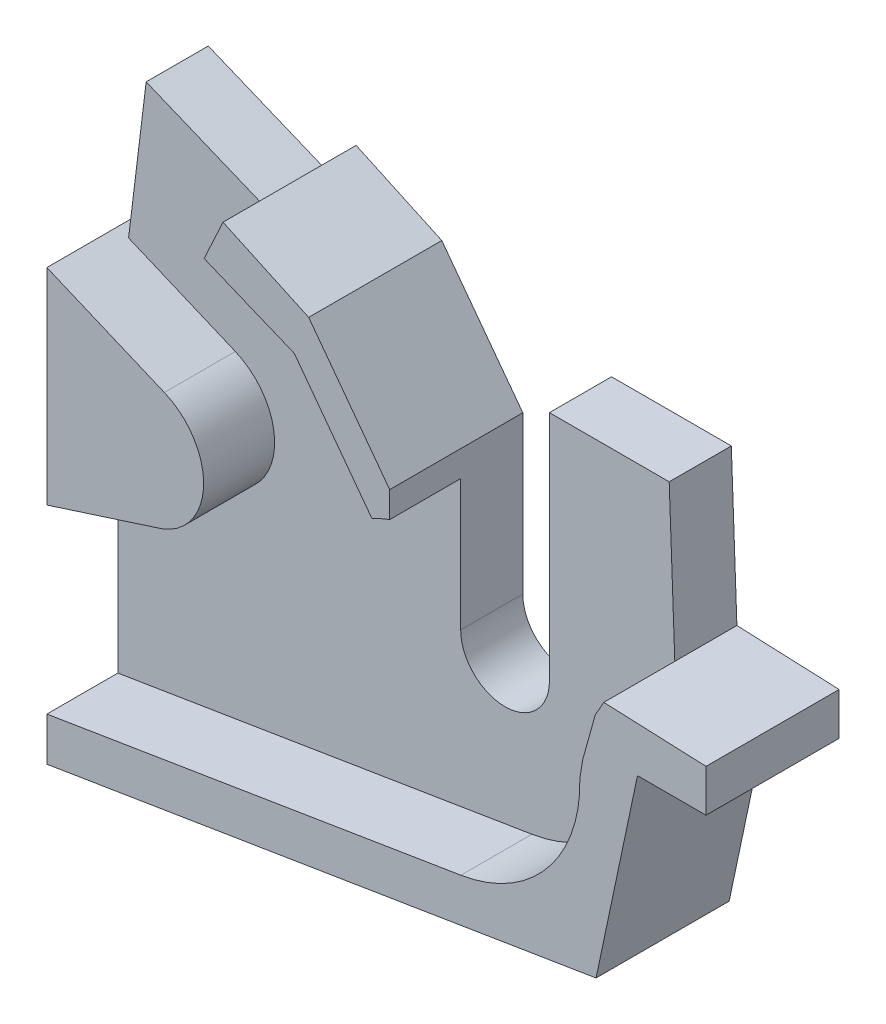
ISO-10303-21;
HEADER;
FILE_DESCRIPTION(('STEP AP214'),'2;1');
FILE_NAME('part.step','',(''),(''),'','','');
FILE_SCHEMA(('AUTOMOTIVE_DESIGN { 1 0 10303 214 1 1 1 1 }'));
ENDSEC;
DATA;
#1=APPLICATION_CONTEXT('core data for automotive mechanical design processes');
#2=APPLICATION_PROTOCOL_DEFINITION('international standard','automotive_design',2000,#1);
#3=PRODUCT_CONTEXT('',#1,'mechanical');
#4=PRODUCT('Part','Part','',(#3));
#5=PRODUCT_RELATED_PRODUCT_CATEGORY('part','',(#4));
#6=PRODUCT_DEFINITION_FORMATION('','',#4);
#7=PRODUCT_DEFINITION_CONTEXT('part definition',#1,'design');
#8=PRODUCT_DEFINITION('design','',#6,#7);
#9=PRODUCT_DEFINITION_SHAPE('','',#8);
#10=(LENGTH_UNIT() NAMED_UNIT(*) SI_UNIT(.MILLI.,.METRE.));
#11=(NAMED_UNIT(*) PLANE_ANGLE_UNIT() SI_UNIT($,.RADIAN.));
#12=(NAMED_UNIT(*) SI_UNIT($,.STERADIAN.) SOLID_ANGLE_UNIT());
#13=UNCERTAINTY_MEASURE_WITH_UNIT(LENGTH_MEASURE(1.E-05),#10,'distance_accuracy_value','');
#14=(GEOMETRIC_REPRESENTATION_CONTEXT(3) GLOBAL_UNCERTAINTY_ASSIGNED_CONTEXT((#13)) GLOBAL_UNIT_ASSIGNED_CONTEXT((#10,
#11,#12)) REPRESENTATION_CONTEXT('',''));
#15=CARTESIAN_POINT('',(0.,0.,0.));
#16=DIRECTION('',(0.,0.,1.));
#17=DIRECTION('',(1.,0.,0.));
#18=AXIS2_PLACEMENT_3D('',#15,#16,#17);
#19=CARTESIAN_POINT('',(0.,0.,7.));
#20=DIRECTION('',(0.,0.,1.));
#21=DIRECTION('',(1.,0.,0.));
#22=AXIS2_PLACEMENT_3D('',#19,#20,#21);
#23=PLANE('',#22);
#24=DIRECTION('',(-0.986991690227506,-0.160771276731423,0.));
#25=VECTOR('',#24,1.);
#26=CARTESIAN_POINT('',(2.26037687324573,-13.8766901403845,7.));
#27=LINE('',#26,#25);
#28=CARTESIAN_POINT('',(7.11861567812569,-13.0853306354766,7.));
#29=VERTEX_POINT('',#28);
#30=CARTESIAN_POINT('',(-39.5424333152486,-20.6859583758814,7.));
#31=VERTEX_POINT('',#30);
#32=EDGE_CURVE('E415',#29,#31,#27,.T.);
#33=ORIENTED_EDGE('',*,*,#32,.F.);
#34=CARTESIAN_POINT('',(4.59071046144304,2.65120936965711,7.));
#35=DIRECTION('',(0.,0.,1.));
#36=DIRECTION('',(1.,0.,0.));
#37=AXIS2_PLACEMENT_3D('',#34,#35,#36);
#38=CIRCLE('',#37,15.9382871136676);
#39=CARTESIAN_POINT('',(20.5233035123729,3.07720795083632,7.));
#40=VERTEX_POINT('',#39);
#41=EDGE_CURVE('E336',#40,#29,#38,.F.);
#42=ORIENTED_EDGE('',*,*,#41,.F.);
#43=DIRECTION('',(0.161052296150216,0.98694587384757,0.));
#44=VECTOR('',#43,1.);
#45=CARTESIAN_POINT('',(19.5018514131188,-3.18236088978088,7.));
#46=LINE('',#45,#44);
#47=CARTESIAN_POINT('',(20.8501257943456,5.0800102106292,7.));
#48=VERTEX_POINT('',#47);
#49=EDGE_CURVE('E341',#40,#48,#46,.T.);
#50=ORIENTED_EDGE('',*,*,#49,.T.);
#51=DIRECTION('',(0.268749678176345,0.963210055221659,0.));
#52=VECTOR('',#51,1.);
#53=CARTESIAN_POINT('',(18.0291728908629,-5.03040264783163,7.));
#54=LINE('',#53,#52);
#55=CARTESIAN_POINT('',(22.2571862666276,10.1229736270083,7.));
#56=VERTEX_POINT('',#55);
#57=EDGE_CURVE('E407',#48,#56,#54,.T.);
#58=ORIENTED_EDGE('',*,*,#57,.T.);
#59=DIRECTION('',(0.491293878545191,0.87099387190957,0.));
#60=VECTOR('',#59,1.);
#61=CARTESIAN_POINT('',(12.553214742302,-7.08078180324617,7.));
#62=LINE('',#61,#60);
#63=CARTESIAN_POINT('',(23.2245967998316,11.83805432074,7.));
#64=VERTEX_POINT('',#63);
#65=EDGE_CURVE('E411',#56,#64,#62,.T.);
#66=ORIENTED_EDGE('',*,*,#65,.T.);
#67=DIRECTION('',(0.0365725060444202,-0.999331002121735,0.));
#68=VECTOR('',#67,1.);
#69=CARTESIAN_POINT('',(23.6261904545896,0.864647440510251,7.));
#70=LINE('',#69,#68);
#71=CARTESIAN_POINT('',(22.5946169567633,29.0520343287084,7.));
#72=VERTEX_POINT('',#71);
#73=EDGE_CURVE('E504',#72,#64,#70,.T.);
#74=ORIENTED_EDGE('',*,*,#73,.F.);
#75=DIRECTION('',(1.,0.,0.));
#76=VECTOR('',#75,1.);
#77=CARTESIAN_POINT('',(0.,29.0520343287084,7.));
#78=LINE('',#77,#76);
#79=CARTESIAN_POINT('',(9.09461695676328,29.0520343287084,7.));
#80=VERTEX_POINT('',#79);
#81=EDGE_CURVE('E508',#80,#72,#78,.T.);
#82=ORIENTED_EDGE('',*,*,#81,.F.);
#83=DIRECTION('',(0.,1.,0.));
#84=VECTOR('',#83,1.);
#85=CARTESIAN_POINT('',(9.09461695676327,0.,7.));
#86=LINE('',#85,#84);
#87=CARTESIAN_POINT('',(9.09461695676328,2.84690158384109,7.));
#88=VERTEX_POINT('',#87);
#89=EDGE_CURVE('E513',#88,#80,#86,.T.);
#90=ORIENTED_EDGE('',*,*,#89,.F.);
#91=CARTESIAN_POINT('',(4.09461695676328,2.84690158384109,7.));
#92=DIRECTION('',(0.,0.,1.));
#93=DIRECTION('',(1.,0.,0.));
#94=AXIS2_PLACEMENT_3D('',#91,#92,#93);
#95=CIRCLE('',#94,5.);
#96=CARTESIAN_POINT('',(-0.905383043236726,2.84690158384109,7.));
#97=VERTEX_POINT('',#96);
#98=EDGE_CURVE('E517',#97,#88,#95,.T.);
#99=ORIENTED_EDGE('',*,*,#98,.F.);
#100=DIRECTION('',(0.,1.,0.));
#101=VECTOR('',#100,1.);
#102=CARTESIAN_POINT('',(-0.905383043236726,0.,7.));
#103=LINE('',#102,#101);
#104=CARTESIAN_POINT('',(-0.905383043236726,17.6118895783081,7.));
#105=VERTEX_POINT('',#104);
#106=EDGE_CURVE('E521',#97,#105,#103,.T.);
#107=ORIENTED_EDGE('',*,*,#106,.T.);
#108=CARTESIAN_POINT('',(4.59071046144304,2.65120936965711,7.));
#109=DIRECTION('',(0.,0.,1.));
#110=DIRECTION('',(1.,0.,0.));
#111=AXIS2_PLACEMENT_3D('',#108,#109,#110);
#112=CIRCLE('',#111,15.9382871136676);
#113=CARTESIAN_POINT('',(-2.91081483109304,16.7137878815498,7.));
#114=VERTEX_POINT('',#113);
#115=EDGE_CURVE('E466',#114,#105,#112,.F.);
#116=ORIENTED_EDGE('',*,*,#115,.F.);
#117=DIRECTION('',(-0.597154043000676,0.80212657911825,0.));
#118=VECTOR('',#117,1.);
#119=CARTESIAN_POINT('',(6.13295078638982,4.56575863829711,7.));
#120=LINE('',#119,#118);
#121=CARTESIAN_POINT('',(-11.6541558172489,28.4582720351665,7.));
#122=VERTEX_POINT('',#121);
#123=EDGE_CURVE('E458',#114,#122,#120,.T.);
#124=ORIENTED_EDGE('',*,*,#123,.T.);
#125=DIRECTION('',(-0.924896016311361,0.380220145457044,0.));
#126=VECTOR('',#125,1.);
#127=CARTESIAN_POINT('',(8.32294203373935,20.245786613286,7.));
#128=LINE('',#127,#126);
#129=CARTESIAN_POINT('',(-21.821876556932,32.6381713864763,7.));
#130=VERTEX_POINT('',#129);
#131=EDGE_CURVE('E462',#122,#130,#128,.T.);
#132=ORIENTED_EDGE('',*,*,#131,.T.);
#133=DIRECTION('',(0.92489601631136,-0.380220145457044,0.));
#134=VECTOR('',#133,1.);
#135=CARTESIAN_POINT('',(8.32294203373935,20.245786613286,7.));
#136=LINE('',#135,#134);
#137=CARTESIAN_POINT('',(-36.3533128313413,38.6119724587211,7.));
#138=VERTEX_POINT('',#137);
#139=EDGE_CURVE('E525',#138,#130,#136,.T.);
#140=ORIENTED_EDGE('',*,*,#139,.F.);
#141=DIRECTION('',(0.121173466197604,0.99263134702147,0.));
#142=VECTOR('',#141,1.);
#143=CARTESIAN_POINT('',(-40.4638072950435,4.93953752337649,7.));
#144=LINE('',#143,#142);
#145=CARTESIAN_POINT('',(-38.3340150262246,22.386414591546,7.));
#146=VERTEX_POINT('',#145);
#147=EDGE_CURVE('E529',#146,#138,#144,.T.);
#148=ORIENTED_EDGE('',*,*,#147,.F.);
#149=DIRECTION('',(-0.921598965108976,0.388143462536812,0.));
#150=VECTOR('',#149,1.);
#151=CARTESIAN_POINT('',(2.23267851269141,5.30122082507651,7.));
#152=LINE('',#151,#150);
#153=CARTESIAN_POINT('',(-26.3036252416232,17.3196585257875,7.));
#154=VERTEX_POINT('',#153);
#155=EDGE_CURVE('E12',#154,#146,#152,.T.);
#156=ORIENTED_EDGE('',*,*,#155,.F.);
#157=CARTESIAN_POINT('',(-29.1124420816076,10.6504680259867,7.));
#158=DIRECTION('',(0.,0.,1.));
#159=DIRECTION('',(1.,0.,0.));
#160=AXIS2_PLACEMENT_3D('',#157,#158,#159);
#161=CIRCLE('',#160,7.2365429566342);
#162=CARTESIAN_POINT('',(-26.4322541037628,3.92855264667495,7.));
#163=VERTEX_POINT('',#162);
#164=EDGE_CURVE('E643',#154,#163,#161,.F.);
#165=ORIENTED_EDGE('',*,*,#164,.T.);
#166=DIRECTION('',(-0.951986528932336,-0.306139916919312,0.));
#167=VECTOR('',#166,1.);
#168=CARTESIAN_POINT('',(-3.62221604820061,11.263806815752,7.));
#169=LINE('',#168,#167);
#170=CARTESIAN_POINT('',(-39.5424333152486,-0.287420009054549,7.));
#171=VERTEX_POINT('',#170);
#172=EDGE_CURVE('E146',#163,#171,#169,.T.);
#173=ORIENTED_EDGE('',*,*,#172,.T.);
#174=DIRECTION('',(0.,-1.,0.));
#175=VECTOR('',#174,1.);
#176=CARTESIAN_POINT('',(-39.5424333152486,0.,7.));
#177=LINE('',#176,#175);
#178=EDGE_CURVE('E532',#171,#31,#177,.T.);
#179=ORIENTED_EDGE('',*,*,#178,.T.);
#180=EDGE_LOOP('',(#33,#42,#50,#58,#66,#74,#82,#90,#99,#107,#116,#124,#132,#140,#148,#156,#165,
#173,#179));
#181=FACE_BOUND('',#180,.T.);
#182=ADVANCED_FACE('F137',(#181),#23,.T.);
#183=CARTESIAN_POINT('',(23.6261904545896,0.864647440510251,7.));
#184=DIRECTION('',(0.999331002121735,0.0365725060444202,0.));
#185=DIRECTION('',(-0.0365725060444202,0.999331002121735,0.));
#186=AXIS2_PLACEMENT_3D('',#183,#184,#185);
#187=PLANE('',#186);
#188=DIRECTION('',(0.0365725060444202,-0.999331002121735,0.));
#189=VECTOR('',#188,1.);
#190=CARTESIAN_POINT('',(23.6261904545896,0.864647440510251,0.));
#191=LINE('',#190,#189);
#192=CARTESIAN_POINT('',(22.5946169567633,29.0520343287084,0.));
#193=VERTEX_POINT('',#192);
#194=CARTESIAN_POINT('',(23.2245967998316,11.83805432074,0.));
#195=VERTEX_POINT('',#194);
#196=EDGE_CURVE('E540',#193,#195,#191,.T.);
#197=ORIENTED_EDGE('',*,*,#196,.F.);
#198=DIRECTION('',(0.,0.,-1.));
#199=VECTOR('',#198,1.);
#200=CARTESIAN_POINT('',(22.5946169567633,29.0520343287084,7.));
#201=LINE('',#200,#199);
#202=EDGE_CURVE('E637',#72,#193,#201,.T.);
#203=ORIENTED_EDGE('',*,*,#202,.F.);
#204=ORIENTED_EDGE('',*,*,#73,.T.);
#205=DIRECTION('',(0.,0.,-1.));
#206=VECTOR('',#205,1.);
#207=CARTESIAN_POINT('',(23.2245967998316,11.83805432074,7.));
#208=LINE('',#207,#206);
#209=EDGE_CURVE('E640',#64,#195,#208,.T.);
#210=ORIENTED_EDGE('',*,*,#209,.T.);
#211=EDGE_LOOP('',(#197,#203,#204,#210));
#212=FACE_BOUND('',#211,.T.);
#213=ADVANCED_FACE('F755',(#212),#187,.T.);
#214=CARTESIAN_POINT('',(0.,29.0520343287084,7.));
#215=DIRECTION('',(0.,1.,0.));
#216=DIRECTION('',(0.,0.,1.));
#217=AXIS2_PLACEMENT_3D('',#214,#215,#216);
#218=PLANE('',#217);
#219=DIRECTION('',(1.,0.,0.));
#220=VECTOR('',#219,1.);
#221=CARTESIAN_POINT('',(0.,29.0520343287084,0.));
#222=LINE('',#221,#220);
#223=CARTESIAN_POINT('',(9.09461695676328,29.0520343287084,0.));
#224=VERTEX_POINT('',#223);
#225=EDGE_CURVE('E544',#224,#193,#222,.T.);
#226=ORIENTED_EDGE('',*,*,#225,.F.);
#227=DIRECTION('',(0.,0.,-1.));
#228=VECTOR('',#227,1.);
#229=CARTESIAN_POINT('',(9.09461695676328,29.0520343287084,7.));
#230=LINE('',#229,#228);
#231=EDGE_CURVE('E634',#80,#224,#230,.T.);
#232=ORIENTED_EDGE('',*,*,#231,.F.);
#233=ORIENTED_EDGE('',*,*,#81,.T.);
#234=ORIENTED_EDGE('',*,*,#202,.T.);
#235=EDGE_LOOP('',(#226,#232,#233,#234));
#236=FACE_BOUND('',#235,.T.);
#237=ADVANCED_FACE('F695',(#236),#218,.T.);
#238=CARTESIAN_POINT('',(9.09461695676327,0.,7.));
#239=DIRECTION('',(-1.,0.,0.));
#240=DIRECTION('',(0.,-1.,0.));
#241=AXIS2_PLACEMENT_3D('',#238,#239,#240);
#242=PLANE('',#241);
#243=DIRECTION('',(0.,1.,0.));
#244=VECTOR('',#243,1.);
#245=CARTESIAN_POINT('',(9.09461695676327,0.,0.));
#246=LINE('',#245,#244);
#247=CARTESIAN_POINT('',(9.09461695676328,2.84690158384109,0.));
#248=VERTEX_POINT('',#247);
#249=EDGE_CURVE('E548',#248,#224,#246,.T.);
#250=ORIENTED_EDGE('',*,*,#249,.F.);
#251=DIRECTION('',(0.,0.,-1.));
#252=VECTOR('',#251,1.);
#253=CARTESIAN_POINT('',(9.09461695676328,2.84690158384109,7.));
#254=LINE('',#253,#252);
#255=EDGE_CURVE('E631',#88,#248,#254,.T.);
#256=ORIENTED_EDGE('',*,*,#255,.F.);
#257=ORIENTED_EDGE('',*,*,#89,.T.);
#258=ORIENTED_EDGE('',*,*,#231,.T.);
#259=EDGE_LOOP('',(#250,#256,#257,#258));
#260=FACE_BOUND('',#259,.T.);
#261=ADVANCED_FACE('F699',(#260),#242,.T.);
#262=CARTESIAN_POINT('',(4.09461695676328,2.84690158384109,7.));
#263=DIRECTION('',(0.,0.,-1.));
#264=DIRECTION('',(-1.,0.,0.));
#265=AXIS2_PLACEMENT_3D('',#262,#263,#264);
#266=CYLINDRICAL_SURFACE('',#265,5.);
#267=CARTESIAN_POINT('',(4.09461695676328,2.84690158384109,0.));
#268=DIRECTION('',(0.,0.,1.));
#269=DIRECTION('',(1.,0.,0.));
#270=AXIS2_PLACEMENT_3D('',#267,#268,#269);
#271=CIRCLE('',#270,5.);
#272=CARTESIAN_POINT('',(-0.905383043236726,2.84690158384109,0.));
#273=VERTEX_POINT('',#272);
#274=EDGE_CURVE('E552',#273,#248,#271,.T.);
#275=ORIENTED_EDGE('',*,*,#274,.F.);
#276=DIRECTION('',(0.,0.,-1.));
#277=VECTOR('',#276,1.);
#278=CARTESIAN_POINT('',(-0.905383043236726,2.84690158384109,7.));
#279=LINE('',#278,#277);
#280=EDGE_CURVE('E628',#97,#273,#279,.T.);
#281=ORIENTED_EDGE('',*,*,#280,.F.);
#282=ORIENTED_EDGE('',*,*,#98,.T.);
#283=ORIENTED_EDGE('',*,*,#255,.T.);
#284=EDGE_LOOP('',(#275,#281,#282,#283));
#285=FACE_BOUND('',#284,.T.);
#286=ADVANCED_FACE('F703',(#285),#266,.F.);
#287=CARTESIAN_POINT('',(-0.905383043236726,0.,7.));
#288=DIRECTION('',(-1.,0.,0.));
#289=DIRECTION('',(0.,0.,1.));
#290=AXIS2_PLACEMENT_3D('',#287,#288,#289);
#291=PLANE('',#290);
#292=DIRECTION('',(0.,1.,0.));
#293=VECTOR('',#292,1.);
#294=CARTESIAN_POINT('',(-0.905383043236726,0.,0.));
#295=LINE('',#294,#293);
#296=CARTESIAN_POINT('',(-0.905383043236726,20.5391363305154,0.));
#297=VERTEX_POINT('',#296);
#298=EDGE_CURVE('E556',#273,#297,#295,.T.);
#299=ORIENTED_EDGE('',*,*,#298,.T.);
#300=DIRECTION('',(0.,0.,-1.));
#301=VECTOR('',#300,1.);
#302=CARTESIAN_POINT('',(-0.905383043236726,20.5391363305154,7.));
#303=LINE('',#302,#301);
#304=CARTESIAN_POINT('',(-0.905383043236726,20.5391363305154,15.));
#305=VERTEX_POINT('',#304);
#306=EDGE_CURVE('E624',#305,#297,#303,.T.);
#307=ORIENTED_EDGE('',*,*,#306,.F.);
#308=DIRECTION('',(0.,1.,0.));
#309=VECTOR('',#308,1.);
#310=CARTESIAN_POINT('',(-0.905383043236726,0.,15.));
#311=LINE('',#310,#309);
#312=CARTESIAN_POINT('',(-0.905383043236726,17.6118895783081,15.));
#313=VERTEX_POINT('',#312);
#314=EDGE_CURVE('E424',#313,#305,#311,.T.);
#315=ORIENTED_EDGE('',*,*,#314,.F.);
#316=DIRECTION('',(0.,0.,-1.));
#317=VECTOR('',#316,1.);
#318=CARTESIAN_POINT('',(-0.905383043236726,17.6118895783081,15.));
#319=LINE('',#318,#317);
#320=EDGE_CURVE('E454',#313,#105,#319,.T.);
#321=ORIENTED_EDGE('',*,*,#320,.T.);
#322=ORIENTED_EDGE('',*,*,#106,.F.);
#323=ORIENTED_EDGE('',*,*,#280,.T.);
#324=EDGE_LOOP('',(#299,#307,#315,#321,#322,#323));
#325=FACE_BOUND('',#324,.T.);
#326=ADVANCED_FACE('F707',(#325),#291,.F.);
#327=CARTESIAN_POINT('',(9.26114189402648,6.90647430874386,7.));
#328=DIRECTION('',(-0.801633281882219,-0.597816093275133,0.));
#329=DIRECTION('',(0.597816093275133,-0.801633281882219,0.));
#330=AXIS2_PLACEMENT_3D('',#327,#328,#329);
#331=PLANE('',#330);
#332=DIRECTION('',(-0.597816093275133,0.801633281882219,0.));
#333=VECTOR('',#332,1.);
#334=CARTESIAN_POINT('',(9.26114189402648,6.90647430874386,0.));
#335=LINE('',#334,#333);
#336=CARTESIAN_POINT('',(-10.0368202056355,32.7838116129957,0.));
#337=VERTEX_POINT('',#336);
#338=EDGE_CURVE('E559',#297,#337,#335,.T.);
#339=ORIENTED_EDGE('',*,*,#338,.T.);
#340=DIRECTION('',(0.,0.,-1.));
#341=VECTOR('',#340,1.);
#342=CARTESIAN_POINT('',(-10.0368202056355,32.7838116129957,7.));
#343=LINE('',#342,#341);
#344=CARTESIAN_POINT('',(-10.0368202056355,32.7838116129957,15.));
#345=VERTEX_POINT('',#344);
#346=EDGE_CURVE('E620',#345,#337,#343,.T.);
#347=ORIENTED_EDGE('',*,*,#346,.F.);
#348=DIRECTION('',(-0.597816093275133,0.801633281882219,0.));
#349=VECTOR('',#348,1.);
#350=CARTESIAN_POINT('',(9.26114189402648,6.90647430874386,15.));
#351=LINE('',#350,#349);
#352=EDGE_CURVE('E428',#305,#345,#351,.T.);
#353=ORIENTED_EDGE('',*,*,#352,.F.);
#354=ORIENTED_EDGE('',*,*,#306,.T.);
#355=EDGE_LOOP('',(#339,#347,#353,#354));
#356=FACE_BOUND('',#355,.T.);
#357=ADVANCED_FACE('F754',(#356),#331,.F.);
#358=CARTESIAN_POINT('',(10.7214720768776,23.1841900245257,7.));
#359=DIRECTION('',(-0.419738295272975,-0.907645174879114,0.));
#360=DIRECTION('',(0.907645174879114,-0.419738295272975,0.));
#361=AXIS2_PLACEMENT_3D('',#358,#359,#360);
#362=PLANE('',#361);
#363=DIRECTION('',(-0.907645174879114,0.419738295272975,0.));
#364=VECTOR('',#363,1.);
#365=CARTESIAN_POINT('',(10.7214720768776,23.1841900245257,0.));
#366=LINE('',#365,#364);
#367=CARTESIAN_POINT('',(-19.6900974837059,37.2479461235265,0.));
#368=VERTEX_POINT('',#367);
#369=EDGE_CURVE('E562',#337,#368,#366,.T.);
#370=ORIENTED_EDGE('',*,*,#369,.T.);
#371=DIRECTION('',(0.,0.,-1.));
#372=VECTOR('',#371,1.);
#373=CARTESIAN_POINT('',(-19.6900974837059,37.2479461235265,7.));
#374=LINE('',#373,#372);
#375=CARTESIAN_POINT('',(-19.6900974837059,37.2479461235265,15.));
#376=VERTEX_POINT('',#375);
#377=EDGE_CURVE('E616',#376,#368,#374,.T.);
#378=ORIENTED_EDGE('',*,*,#377,.F.);
#379=DIRECTION('',(-0.907645174879114,0.419738295272975,0.));
#380=VECTOR('',#379,1.);
#381=CARTESIAN_POINT('',(10.7214720768776,23.1841900245257,15.));
#382=LINE('',#381,#380);
#383=EDGE_CURVE('E432',#345,#376,#382,.T.);
#384=ORIENTED_EDGE('',*,*,#383,.F.);
#385=ORIENTED_EDGE('',*,*,#346,.T.);
#386=EDGE_LOOP('',(#370,#378,#384,#385));
#387=FACE_BOUND('',#386,.T.);
#388=ADVANCED_FACE('F750',(#387),#362,.F.);
#389=CARTESIAN_POINT('',(-30.4115695605835,14.0637560990008,7.));
#390=DIRECTION('',(0.907645174879114,-0.419738295272974,0.));
#391=DIRECTION('',(0.419738295272974,0.907645174879114,0.));
#392=AXIS2_PLACEMENT_3D('',#389,#390,#391);
#393=PLANE('',#392);
#394=DIRECTION('',(-0.419738295272975,-0.907645174879114,0.));
#395=VECTOR('',#394,1.);
#396=CARTESIAN_POINT('',(-30.4115695605835,14.0637560990008,0.));
#397=LINE('',#396,#395);
#398=CARTESIAN_POINT('',(-21.821876556932,32.6381713864763,0.));
#399=VERTEX_POINT('',#398);
#400=EDGE_CURVE('E565',#368,#399,#397,.T.);
#401=ORIENTED_EDGE('',*,*,#400,.T.);
#402=DIRECTION('',(0.,0.,-1.));
#403=VECTOR('',#402,1.);
#404=CARTESIAN_POINT('',(-21.821876556932,32.6381713864763,7.));
#405=LINE('',#404,#403);
#406=EDGE_CURVE('E613',#130,#399,#405,.T.);
#407=ORIENTED_EDGE('',*,*,#406,.F.);
#408=DIRECTION('',(0.,0.,-1.));
#409=VECTOR('',#408,1.);
#410=CARTESIAN_POINT('',(-21.821876556932,32.6381713864763,15.));
#411=LINE('',#410,#409);
#412=CARTESIAN_POINT('',(-21.821876556932,32.6381713864763,15.));
#413=VERTEX_POINT('',#412);
#414=EDGE_CURVE('E451',#413,#130,#411,.T.);
#415=ORIENTED_EDGE('',*,*,#414,.F.);
#416=DIRECTION('',(-0.419738295272975,-0.907645174879114,0.));
#417=VECTOR('',#416,1.);
#418=CARTESIAN_POINT('',(-30.4115695605835,14.0637560990008,15.));
#419=LINE('',#418,#417);
#420=EDGE_CURVE('E436',#376,#413,#419,.T.);
#421=ORIENTED_EDGE('',*,*,#420,.F.);
#422=ORIENTED_EDGE('',*,*,#377,.T.);
#423=EDGE_LOOP('',(#401,#407,#415,#421,#422));
#424=FACE_BOUND('',#423,.T.);
#425=ADVANCED_FACE('F726',(#424),#393,.F.);
#426=CARTESIAN_POINT('',(8.32294203373935,20.245786613286,7.));
#427=DIRECTION('',(0.380220145457044,0.92489601631136,0.));
#428=DIRECTION('',(-0.924896016311361,0.380220145457044,0.));
#429=AXIS2_PLACEMENT_3D('',#426,#427,#428);
#430=PLANE('',#429);
#431=DIRECTION('',(0.92489601631136,-0.380220145457044,0.));
#432=VECTOR('',#431,1.);
#433=CARTESIAN_POINT('',(8.32294203373935,20.245786613286,0.));
#434=LINE('',#433,#432);
#435=CARTESIAN_POINT('',(-36.3533128313413,38.6119724587211,0.));
#436=VERTEX_POINT('',#435);
#437=EDGE_CURVE('E569',#436,#399,#434,.T.);
#438=ORIENTED_EDGE('',*,*,#437,.F.);
#439=DIRECTION('',(0.,0.,-1.));
#440=VECTOR('',#439,1.);
#441=CARTESIAN_POINT('',(-36.3533128313413,38.6119724587211,7.));
#442=LINE('',#441,#440);
#443=EDGE_CURVE('E609',#138,#436,#442,.T.);
#444=ORIENTED_EDGE('',*,*,#443,.F.);
#445=ORIENTED_EDGE('',*,*,#139,.T.);
#446=ORIENTED_EDGE('',*,*,#406,.T.);
#447=EDGE_LOOP('',(#438,#444,#445,#446));
#448=FACE_BOUND('',#447,.T.);
#449=ADVANCED_FACE('F731',(#448),#430,.T.);
#450=CARTESIAN_POINT('',(-40.4638072950435,4.93953752337649,7.));
#451=DIRECTION('',(-0.99263134702147,0.121173466197604,0.));
#452=DIRECTION('',(-0.121173466197604,-0.99263134702147,0.));
#453=AXIS2_PLACEMENT_3D('',#450,#451,#452);
#454=PLANE('',#453);
#455=DIRECTION('',(0.,0.,-1.));
#456=VECTOR('',#455,1.);
#457=CARTESIAN_POINT('',(-38.3340150262246,22.386414591546,7.));
#458=LINE('',#457,#456);
#459=CARTESIAN_POINT('',(-38.3340150262246,22.386414591546,0.));
#460=VERTEX_POINT('',#459);
#461=EDGE_CURVE('E500',#146,#460,#458,.T.);
#462=ORIENTED_EDGE('',*,*,#461,.F.);
#463=ORIENTED_EDGE('',*,*,#147,.T.);
#464=ORIENTED_EDGE('',*,*,#443,.T.);
#465=DIRECTION('',(0.121173466197604,0.99263134702147,0.));
#466=VECTOR('',#465,1.);
#467=CARTESIAN_POINT('',(-40.4638072950435,4.93953752337649,0.));
#468=LINE('',#467,#466);
#469=EDGE_CURVE('E573',#460,#436,#468,.T.);
#470=ORIENTED_EDGE('',*,*,#469,.F.);
#471=EDGE_LOOP('',(#462,#463,#464,#470));
#472=FACE_BOUND('',#471,.T.);
#473=ADVANCED_FACE('F735',(#472),#454,.T.);
#474=CARTESIAN_POINT('',(-39.5424333152486,0.,7.));
#475=DIRECTION('',(1.,0.,0.));
#476=DIRECTION('',(0.,0.,-1.));
#477=AXIS2_PLACEMENT_3D('',#474,#475,#476);
#478=PLANE('',#477);
#479=DIRECTION('',(0.,-1.,0.));
#480=VECTOR('',#479,1.);
#481=CARTESIAN_POINT('',(-39.5424333152486,0.,0.));
#482=LINE('',#481,#480);
#483=CARTESIAN_POINT('',(-39.5424333152486,22.8953557651498,0.));
#484=VERTEX_POINT('',#483);
#485=CARTESIAN_POINT('',(-39.5424333152486,-25.5832715409091,0.));
#486=VERTEX_POINT('',#485);
#487=EDGE_CURVE('E576',#484,#486,#482,.T.);
#488=ORIENTED_EDGE('',*,*,#487,.T.);
#489=DIRECTION('',(0.,0.,-1.));
#490=VECTOR('',#489,1.);
#491=CARTESIAN_POINT('',(-39.5424333152486,-25.5832715409091,7.));
#492=LINE('',#491,#490);
#493=CARTESIAN_POINT('',(-39.5424333152486,-25.5832715409091,15.));
#494=VERTEX_POINT('',#493);
#495=EDGE_CURVE('E605',#494,#486,#492,.T.);
#496=ORIENTED_EDGE('',*,*,#495,.F.);
#497=DIRECTION('',(0.,-1.,0.));
#498=VECTOR('',#497,1.);
#499=CARTESIAN_POINT('',(-39.5424333152486,0.,15.));
#500=LINE('',#499,#498);
#501=CARTESIAN_POINT('',(-39.5424333152486,-20.6859583758814,15.));
#502=VERTEX_POINT('',#501);
#503=EDGE_CURVE('E357',#502,#494,#500,.T.);
#504=ORIENTED_EDGE('',*,*,#503,.F.);
#505=DIRECTION('',(0.,0.,-1.));
#506=VECTOR('',#505,1.);
#507=CARTESIAN_POINT('',(-39.5424333152486,-20.6859583758814,15.));
#508=LINE('',#507,#506);
#509=EDGE_CURVE('E342',#502,#31,#508,.T.);
#510=ORIENTED_EDGE('',*,*,#509,.T.);
#511=ORIENTED_EDGE('',*,*,#178,.F.);
#512=DIRECTION('',(0.,0.,-1.));
#513=VECTOR('',#512,1.);
#514=CARTESIAN_POINT('',(-39.5424333152486,-0.287420009054549,15.));
#515=LINE('',#514,#513);
#516=CARTESIAN_POINT('',(-39.5424333152486,-0.287420009054549,15.));
#517=VERTEX_POINT('',#516);
#518=EDGE_CURVE('E493',#517,#171,#515,.T.);
#519=ORIENTED_EDGE('',*,*,#518,.F.);
#520=DIRECTION('',(0.,-1.,0.));
#521=VECTOR('',#520,1.);
#522=CARTESIAN_POINT('',(-39.5424333152486,0.,15.));
#523=LINE('',#522,#521);
#524=CARTESIAN_POINT('',(-39.5424333152486,22.8953557651498,15.));
#525=VERTEX_POINT('',#524);
#526=EDGE_CURVE('E474',#525,#517,#523,.T.);
#527=ORIENTED_EDGE('',*,*,#526,.F.);
#528=DIRECTION('',(0.,0.,-1.));
#529=VECTOR('',#528,1.);
#530=CARTESIAN_POINT('',(-39.5424333152486,22.8953557651498,15.));
#531=LINE('',#530,#529);
#532=EDGE_CURVE('E496',#525,#484,#531,.T.);
#533=ORIENTED_EDGE('',*,*,#532,.T.);
#534=EDGE_LOOP('',(#488,#496,#504,#510,#511,#519,#527,#533));
#535=FACE_BOUND('',#534,.T.);
#536=ADVANCED_FACE('F656',(#535),#478,.F.);
#537=CARTESIAN_POINT('',(3.03748210589275,-18.6474204763526,7.));
#538=DIRECTION('',(-0.160771276731423,0.986991690227505,0.));
#539=DIRECTION('',(-0.986991690227505,-0.160771276731423,0.));
#540=AXIS2_PLACEMENT_3D('',#537,#538,#539);
#541=PLANE('',#540);
#542=DIRECTION('',(0.986991690227505,0.160771276731423,0.));
#543=VECTOR('',#542,1.);
#544=CARTESIAN_POINT('',(3.03748210589275,-18.6474204763526,0.));
#545=LINE('',#544,#543);
#546=CARTESIAN_POINT('',(22.3518686497977,-15.5012961323552,0.));
#547=VERTEX_POINT('',#546);
#548=EDGE_CURVE('E579',#486,#547,#545,.T.);
#549=ORIENTED_EDGE('',*,*,#548,.T.);
#550=DIRECTION('',(0.,0.,-1.));
#551=VECTOR('',#550,1.);
#552=CARTESIAN_POINT('',(22.3518686497977,-15.5012961323552,7.));
#553=LINE('',#552,#551);
#554=CARTESIAN_POINT('',(22.3518686497977,-15.5012961323552,15.));
#555=VERTEX_POINT('',#554);
#556=EDGE_CURVE('E601',#555,#547,#553,.T.);
#557=ORIENTED_EDGE('',*,*,#556,.F.);
#558=DIRECTION('',(0.986991690227505,0.160771276731423,0.));
#559=VECTOR('',#558,1.);
#560=CARTESIAN_POINT('',(3.03748210589275,-18.6474204763526,15.));
#561=LINE('',#560,#559);
#562=EDGE_CURVE('E360',#494,#555,#561,.T.);
#563=ORIENTED_EDGE('',*,*,#562,.F.);
#564=ORIENTED_EDGE('',*,*,#495,.T.);
#565=EDGE_LOOP('',(#549,#557,#563,#564));
#566=FACE_BOUND('',#565,.T.);
#567=ADVANCED_FACE('F662',(#566),#541,.F.);
#568=CARTESIAN_POINT('',(24.5321534336217,-5.18443205812577,7.));
#569=DIRECTION('',(-0.978390560275521,0.20676535387669,0.));
#570=DIRECTION('',(-0.20676535387669,-0.978390560275521,0.));
#571=AXIS2_PLACEMENT_3D('',#568,#569,#570);
#572=PLANE('',#571);
#573=DIRECTION('',(0.20676535387669,0.978390560275521,0.));
#574=VECTOR('',#573,1.);
#575=CARTESIAN_POINT('',(24.5321534336217,-5.18443205812577,0.));
#576=LINE('',#575,#574);
#577=CARTESIAN_POINT('',(27.018997021446,6.58303403612131,0.));
#578=VERTEX_POINT('',#577);
#579=EDGE_CURVE('E582',#547,#578,#576,.T.);
#580=ORIENTED_EDGE('',*,*,#579,.T.);
#581=DIRECTION('',(0.,0.,-1.));
#582=VECTOR('',#581,1.);
#583=CARTESIAN_POINT('',(27.018997021446,6.58303403612131,7.));
#584=LINE('',#583,#582);
#585=CARTESIAN_POINT('',(27.018997021446,6.58303403612131,15.));
#586=VERTEX_POINT('',#585);
#587=EDGE_CURVE('E597',#586,#578,#584,.T.);
#588=ORIENTED_EDGE('',*,*,#587,.F.);
#589=DIRECTION('',(0.20676535387669,0.978390560275521,0.));
#590=VECTOR('',#589,1.);
#591=CARTESIAN_POINT('',(24.5321534336217,-5.18443205812577,15.));
#592=LINE('',#591,#590);
#593=EDGE_CURVE('E366',#555,#586,#592,.T.);
#594=ORIENTED_EDGE('',*,*,#593,.F.);
#595=ORIENTED_EDGE('',*,*,#556,.T.);
#596=EDGE_LOOP('',(#580,#588,#594,#595));
#597=FACE_BOUND('',#596,.T.);
#598=ADVANCED_FACE('F666',(#597),#572,.F.);
#599=CARTESIAN_POINT('',(0.,6.58303403612132,7.));
#600=DIRECTION('',(0.,1.,0.));
#601=DIRECTION('',(-1.,0.,0.));
#602=AXIS2_PLACEMENT_3D('',#599,#600,#601);
#603=PLANE('',#602);
#604=DIRECTION('',(1.,0.,0.));
#605=VECTOR('',#604,1.);
#606=CARTESIAN_POINT('',(0.,6.58303403612132,0.));
#607=LINE('',#606,#605);
#608=CARTESIAN_POINT('',(34.744303122736,6.58303403612131,0.));
#609=VERTEX_POINT('',#608);
#610=EDGE_CURVE('E585',#578,#609,#607,.T.);
#611=ORIENTED_EDGE('',*,*,#610,.T.);
#612=DIRECTION('',(0.,0.,-1.));
#613=VECTOR('',#612,1.);
#614=CARTESIAN_POINT('',(34.744303122736,6.58303403612131,7.));
#615=LINE('',#614,#613);
#616=CARTESIAN_POINT('',(34.744303122736,6.58303403612131,15.));
#617=VERTEX_POINT('',#616);
#618=EDGE_CURVE('E593',#617,#609,#615,.T.);
#619=ORIENTED_EDGE('',*,*,#618,.F.);
#620=DIRECTION('',(1.,0.,0.));
#621=VECTOR('',#620,1.);
#622=CARTESIAN_POINT('',(0.,6.58303403612132,15.));
#623=LINE('',#622,#621);
#624=EDGE_CURVE('E370',#586,#617,#623,.T.);
#625=ORIENTED_EDGE('',*,*,#624,.F.);
#626=ORIENTED_EDGE('',*,*,#587,.T.);
#627=EDGE_LOOP('',(#611,#619,#625,#626));
#628=FACE_BOUND('',#627,.T.);
#629=ADVANCED_FACE('F672',(#628),#603,.F.);
#630=CARTESIAN_POINT('',(34.744303122736,0.,7.));
#631=DIRECTION('',(-1.,0.,0.));
#632=DIRECTION('',(0.,0.,1.));
#633=AXIS2_PLACEMENT_3D('',#630,#631,#632);
#634=PLANE('',#633);
#635=DIRECTION('',(0.,1.,0.));
#636=VECTOR('',#635,1.);
#637=CARTESIAN_POINT('',(34.744303122736,0.,0.));
#638=LINE('',#637,#636);
#639=CARTESIAN_POINT('',(34.744303122736,11.3546415658289,0.));
#640=VERTEX_POINT('',#639);
#641=EDGE_CURVE('E509',#609,#640,#638,.T.);
#642=ORIENTED_EDGE('',*,*,#641,.T.);
#643=DIRECTION('',(0.,0.,-1.));
#644=VECTOR('',#643,1.);
#645=CARTESIAN_POINT('',(34.744303122736,11.3546415658289,7.));
#646=LINE('',#645,#644);
#647=CARTESIAN_POINT('',(34.744303122736,11.3546415658289,15.));
#648=VERTEX_POINT('',#647);
#649=EDGE_CURVE('E536',#648,#640,#646,.T.);
#650=ORIENTED_EDGE('',*,*,#649,.F.);
#651=DIRECTION('',(0.,1.,0.));
#652=VECTOR('',#651,1.);
#653=CARTESIAN_POINT('',(34.744303122736,0.,15.));
#654=LINE('',#653,#652);
#655=EDGE_CURVE('E374',#617,#648,#654,.T.);
#656=ORIENTED_EDGE('',*,*,#655,.F.);
#657=ORIENTED_EDGE('',*,*,#618,.T.);
#658=EDGE_LOOP('',(#642,#650,#656,#657));
#659=FACE_BOUND('',#658,.T.);
#660=ADVANCED_FACE('F676',(#659),#634,.F.);
#661=CARTESIAN_POINT('',(0.536724699134198,12.7901277892678,7.));
#662=DIRECTION('',(0.0419270824807038,0.999120673269579,0.));
#663=DIRECTION('',(-0.999120673269579,0.0419270824807038,0.));
#664=AXIS2_PLACEMENT_3D('',#661,#662,#663);
#665=PLANE('',#664);
#666=DIRECTION('',(0.999120673269579,-0.0419270824807038,0.));
#667=VECTOR('',#666,1.);
#668=CARTESIAN_POINT('',(0.536724699134198,12.7901277892678,0.));
#669=LINE('',#668,#667);
#670=EDGE_CURVE('E503',#195,#640,#669,.T.);
#671=ORIENTED_EDGE('',*,*,#670,.F.);
#672=ORIENTED_EDGE('',*,*,#209,.F.);
#673=DIRECTION('',(0.,0.,-1.));
#674=VECTOR('',#673,1.);
#675=CARTESIAN_POINT('',(23.2245967998316,11.83805432074,15.));
#676=LINE('',#675,#674);
#677=CARTESIAN_POINT('',(23.2245967998316,11.83805432074,15.));
#678=VERTEX_POINT('',#677);
#679=EDGE_CURVE('E399',#678,#64,#676,.T.);
#680=ORIENTED_EDGE('',*,*,#679,.F.);
#681=DIRECTION('',(0.999120673269579,-0.0419270824807038,0.));
#682=VECTOR('',#681,1.);
#683=CARTESIAN_POINT('',(0.536724699134198,12.7901277892678,15.));
#684=LINE('',#683,#682);
#685=EDGE_CURVE('E378',#678,#648,#684,.T.);
#686=ORIENTED_EDGE('',*,*,#685,.T.);
#687=ORIENTED_EDGE('',*,*,#649,.T.);
#688=EDGE_LOOP('',(#671,#672,#680,#686,#687));
#689=FACE_BOUND('',#688,.T.);
#690=ADVANCED_FACE('F139',(#689),#665,.T.);
#691=CARTESIAN_POINT('',(0.,0.,0.));
#692=DIRECTION('',(0.,0.,1.));
#693=DIRECTION('',(1.,0.,0.));
#694=AXIS2_PLACEMENT_3D('',#691,#692,#693);
#695=PLANE('',#694);
#696=ORIENTED_EDGE('',*,*,#548,.F.);
#697=ORIENTED_EDGE('',*,*,#487,.F.);
#698=DIRECTION('',(0.921598965108976,-0.388143462536812,0.));
#699=VECTOR('',#698,1.);
#700=CARTESIAN_POINT('',(2.23267851269141,5.30122082507651,0.));
#701=LINE('',#700,#699);
#702=EDGE_CURVE('E469',#484,#460,#701,.T.);
#703=ORIENTED_EDGE('',*,*,#702,.T.);
#704=ORIENTED_EDGE('',*,*,#469,.T.);
#705=ORIENTED_EDGE('',*,*,#437,.T.);
#706=ORIENTED_EDGE('',*,*,#400,.F.);
#707=ORIENTED_EDGE('',*,*,#369,.F.);
#708=ORIENTED_EDGE('',*,*,#338,.F.);
#709=ORIENTED_EDGE('',*,*,#298,.F.);
#710=ORIENTED_EDGE('',*,*,#274,.T.);
#711=ORIENTED_EDGE('',*,*,#249,.T.);
#712=ORIENTED_EDGE('',*,*,#225,.T.);
#713=ORIENTED_EDGE('',*,*,#196,.T.);
#714=ORIENTED_EDGE('',*,*,#670,.T.);
#715=ORIENTED_EDGE('',*,*,#641,.F.);
#716=ORIENTED_EDGE('',*,*,#610,.F.);
#717=ORIENTED_EDGE('',*,*,#579,.F.);
#718=EDGE_LOOP('',(#696,#697,#703,#704,#705,#706,#707,#708,#709,#710,#711,#712,#713,#714,#715,
#716,#717));
#719=FACE_BOUND('',#718,.T.);
#720=ADVANCED_FACE('F669',(#719),#695,.F.);
#721=CARTESIAN_POINT('',(2.23267851269141,5.30122082507651,15.));
#722=DIRECTION('',(0.388143462536812,0.921598965108976,0.));
#723=DIRECTION('',(-0.921598965108976,0.388143462536812,0.));
#724=AXIS2_PLACEMENT_3D('',#721,#722,#723);
#725=PLANE('',#724);
#726=ORIENTED_EDGE('',*,*,#155,.T.);
#727=ORIENTED_EDGE('',*,*,#461,.T.);
#728=ORIENTED_EDGE('',*,*,#702,.F.);
#729=ORIENTED_EDGE('',*,*,#532,.F.);
#730=DIRECTION('',(0.921598965108976,-0.388143462536812,0.));
#731=VECTOR('',#730,1.);
#732=CARTESIAN_POINT('',(2.23267851269141,5.30122082507651,15.));
#733=LINE('',#732,#731);
#734=CARTESIAN_POINT('',(-26.3036252416232,17.3196585257875,15.));
#735=VERTEX_POINT('',#734);
#736=EDGE_CURVE('E470',#525,#735,#733,.T.);
#737=ORIENTED_EDGE('',*,*,#736,.T.);
#738=DIRECTION('',(0.,0.,-1.));
#739=VECTOR('',#738,1.);
#740=CARTESIAN_POINT('',(-26.3036252416232,17.3196585257875,15.));
#741=LINE('',#740,#739);
#742=EDGE_CURVE('E483',#735,#154,#741,.T.);
#743=ORIENTED_EDGE('',*,*,#742,.T.);
#744=EDGE_LOOP('',(#726,#727,#728,#729,#737,#743));
#745=FACE_BOUND('',#744,.T.);
#746=ADVANCED_FACE('F737',(#745),#725,.T.);
#747=CARTESIAN_POINT('',(-3.62221604820061,11.263806815752,15.));
#748=DIRECTION('',(-0.306139916919312,0.951986528932336,0.));
#749=DIRECTION('',(-0.951986528932336,-0.306139916919312,0.));
#750=AXIS2_PLACEMENT_3D('',#747,#748,#749);
#751=PLANE('',#750);
#752=ORIENTED_EDGE('',*,*,#172,.F.);
#753=DIRECTION('',(0.,0.,-1.));
#754=VECTOR('',#753,1.);
#755=CARTESIAN_POINT('',(-26.4322541037628,3.92855264667495,15.));
#756=LINE('',#755,#754);
#757=CARTESIAN_POINT('',(-26.4322541037628,3.92855264667495,15.));
#758=VERTEX_POINT('',#757);
#759=EDGE_CURVE('E490',#758,#163,#756,.T.);
#760=ORIENTED_EDGE('',*,*,#759,.F.);
#761=DIRECTION('',(0.951986528932336,0.306139916919312,0.));
#762=VECTOR('',#761,1.);
#763=CARTESIAN_POINT('',(-3.62221604820061,11.263806815752,15.));
#764=LINE('',#763,#762);
#765=EDGE_CURVE('E477',#517,#758,#764,.T.);
#766=ORIENTED_EDGE('',*,*,#765,.F.);
#767=ORIENTED_EDGE('',*,*,#518,.T.);
#768=EDGE_LOOP('',(#752,#760,#766,#767));
#769=FACE_BOUND('',#768,.T.);
#770=ADVANCED_FACE('F744',(#769),#751,.F.);
#771=CARTESIAN_POINT('',(-29.1124420816076,10.6504680259867,15.));
#772=DIRECTION('',(0.,0.,-1.));
#773=DIRECTION('',(-1.,0.,0.));
#774=AXIS2_PLACEMENT_3D('',#771,#772,#773);
#775=CYLINDRICAL_SURFACE('',#774,7.2365429566342);
#776=ORIENTED_EDGE('',*,*,#164,.F.);
#777=ORIENTED_EDGE('',*,*,#742,.F.);
#778=CARTESIAN_POINT('',(-29.1124420816076,10.6504680259867,15.));
#779=DIRECTION('',(0.,0.,1.));
#780=DIRECTION('',(1.,0.,0.));
#781=AXIS2_PLACEMENT_3D('',#778,#779,#780);
#782=CIRCLE('',#781,7.2365429566342);
#783=EDGE_CURVE('E480',#758,#735,#782,.T.);
#784=ORIENTED_EDGE('',*,*,#783,.F.);
#785=ORIENTED_EDGE('',*,*,#759,.T.);
#786=EDGE_LOOP('',(#776,#777,#784,#785));
#787=FACE_BOUND('',#786,.T.);
#788=ADVANCED_FACE('F743',(#787),#775,.T.);
#789=CARTESIAN_POINT('',(0.,0.,15.));
#790=DIRECTION('',(0.,0.,1.));
#791=DIRECTION('',(1.,0.,0.));
#792=AXIS2_PLACEMENT_3D('',#789,#790,#791);
#793=PLANE('',#792);
#794=ORIENTED_EDGE('',*,*,#736,.F.);
#795=ORIENTED_EDGE('',*,*,#526,.T.);
#796=ORIENTED_EDGE('',*,*,#765,.T.);
#797=ORIENTED_EDGE('',*,*,#783,.T.);
#798=EDGE_LOOP('',(#794,#795,#796,#797));
#799=FACE_BOUND('',#798,.T.);
#800=ADVANCED_FACE('F746',(#799),#793,.T.);
#801=CARTESIAN_POINT('',(4.59071046144304,2.65120936965711,15.));
#802=DIRECTION('',(0.,0.,-1.));
#803=DIRECTION('',(-1.,0.,0.));
#804=AXIS2_PLACEMENT_3D('',#801,#802,#803);
#805=CYLINDRICAL_SURFACE('',#804,15.9382871136676);
#806=DIRECTION('',(0.,0.,-1.));
#807=VECTOR('',#806,1.);
#808=CARTESIAN_POINT('',(-2.91081483109304,16.7137878815498,15.));
#809=LINE('',#808,#807);
#810=CARTESIAN_POINT('',(-2.91081483109304,16.7137878815498,15.));
#811=VERTEX_POINT('',#810);
#812=EDGE_CURVE('E445',#811,#114,#809,.T.);
#813=ORIENTED_EDGE('',*,*,#812,.T.);
#814=ORIENTED_EDGE('',*,*,#115,.T.);
#815=ORIENTED_EDGE('',*,*,#320,.F.);
#816=CARTESIAN_POINT('',(4.59071046144304,2.65120936965711,15.));
#817=DIRECTION('',(0.,0.,1.));
#818=DIRECTION('',(1.,0.,0.));
#819=AXIS2_PLACEMENT_3D('',#816,#817,#818);
#820=CIRCLE('',#819,15.9382871136676);
#821=EDGE_CURVE('E420',#313,#811,#820,.T.);
#822=ORIENTED_EDGE('',*,*,#821,.T.);
#823=EDGE_LOOP('',(#813,#814,#815,#822));
#824=FACE_BOUND('',#823,.T.);
#825=ADVANCED_FACE('F711',(#824),#805,.F.);
#826=CARTESIAN_POINT('',(8.32294203373935,20.245786613286,15.));
#827=DIRECTION('',(0.380220145457044,0.92489601631136,0.));
#828=DIRECTION('',(-0.924896016311361,0.380220145457044,0.));
#829=AXIS2_PLACEMENT_3D('',#826,#827,#828);
#830=PLANE('',#829);
#831=ORIENTED_EDGE('',*,*,#131,.F.);
#832=DIRECTION('',(0.,0.,-1.));
#833=VECTOR('',#832,1.);
#834=CARTESIAN_POINT('',(-11.6541558172489,28.4582720351665,15.));
#835=LINE('',#834,#833);
#836=CARTESIAN_POINT('',(-11.6541558172489,28.4582720351665,15.));
#837=VERTEX_POINT('',#836);
#838=EDGE_CURVE('E161',#837,#122,#835,.T.);
#839=ORIENTED_EDGE('',*,*,#838,.F.);
#840=DIRECTION('',(0.92489601631136,-0.380220145457044,0.));
#841=VECTOR('',#840,1.);
#842=CARTESIAN_POINT('',(8.32294203373935,20.245786613286,15.));
#843=LINE('',#842,#841);
#844=EDGE_CURVE('E439',#413,#837,#843,.T.);
#845=ORIENTED_EDGE('',*,*,#844,.F.);
#846=ORIENTED_EDGE('',*,*,#414,.T.);
#847=EDGE_LOOP('',(#831,#839,#845,#846));
#848=FACE_BOUND('',#847,.T.);
#849=ADVANCED_FACE('F721',(#848),#830,.F.);
#850=CARTESIAN_POINT('',(6.13295078638982,4.56575863829711,15.));
#851=DIRECTION('',(0.80212657911825,0.597154043000676,0.));
#852=DIRECTION('',(-0.597154043000676,0.80212657911825,0.));
#853=AXIS2_PLACEMENT_3D('',#850,#851,#852);
#854=PLANE('',#853);
#855=ORIENTED_EDGE('',*,*,#123,.F.);
#856=ORIENTED_EDGE('',*,*,#812,.F.);
#857=DIRECTION('',(0.597154043000676,-0.80212657911825,0.));
#858=VECTOR('',#857,1.);
#859=CARTESIAN_POINT('',(6.13295078638982,4.56575863829711,15.));
#860=LINE('',#859,#858);
#861=EDGE_CURVE('E442',#837,#811,#860,.T.);
#862=ORIENTED_EDGE('',*,*,#861,.F.);
#863=ORIENTED_EDGE('',*,*,#838,.T.);
#864=EDGE_LOOP('',(#855,#856,#862,#863));
#865=FACE_BOUND('',#864,.T.);
#866=ADVANCED_FACE('F714',(#865),#854,.F.);
#867=CARTESIAN_POINT('',(0.,0.,15.));
#868=DIRECTION('',(0.,0.,1.));
#869=DIRECTION('',(1.,0.,0.));
#870=AXIS2_PLACEMENT_3D('',#867,#868,#869);
#871=PLANE('',#870);
#872=ORIENTED_EDGE('',*,*,#821,.F.);
#873=ORIENTED_EDGE('',*,*,#314,.T.);
#874=ORIENTED_EDGE('',*,*,#352,.T.);
#875=ORIENTED_EDGE('',*,*,#383,.T.);
#876=ORIENTED_EDGE('',*,*,#420,.T.);
#877=ORIENTED_EDGE('',*,*,#844,.T.);
#878=ORIENTED_EDGE('',*,*,#861,.T.);
#879=EDGE_LOOP('',(#872,#873,#874,#875,#876,#877,#878));
#880=FACE_BOUND('',#879,.T.);
#881=ADVANCED_FACE('F716',(#880),#871,.T.);
#882=CARTESIAN_POINT('',(4.59071046144304,2.65120936965711,15.));
#883=DIRECTION('',(0.,0.,-1.));
#884=DIRECTION('',(-1.,0.,0.));
#885=AXIS2_PLACEMENT_3D('',#882,#883,#884);
#886=CYLINDRICAL_SURFACE('',#885,15.9382871136676);
#887=DIRECTION('',(0.,0.,-1.));
#888=VECTOR('',#887,1.);
#889=CARTESIAN_POINT('',(20.5233035123729,3.07720795083632,15.));
#890=LINE('',#889,#888);
#891=CARTESIAN_POINT('',(20.5233035123729,3.07720795083632,15.));
#892=VERTEX_POINT('',#891);
#893=EDGE_CURVE('E390',#892,#40,#890,.T.);
#894=ORIENTED_EDGE('',*,*,#893,.T.);
#895=ORIENTED_EDGE('',*,*,#41,.T.);
#896=DIRECTION('',(0.,0.,-1.));
#897=VECTOR('',#896,1.);
#898=CARTESIAN_POINT('',(7.11861567812569,-13.0853306354766,15.));
#899=LINE('',#898,#897);
#900=CARTESIAN_POINT('',(7.11861567812569,-13.0853306354766,15.));
#901=VERTEX_POINT('',#900);
#902=EDGE_CURVE('E330',#901,#29,#899,.T.);
#903=ORIENTED_EDGE('',*,*,#902,.F.);
#904=CARTESIAN_POINT('',(4.59071046144304,2.65120936965711,15.));
#905=DIRECTION('',(0.,0.,1.));
#906=DIRECTION('',(1.,0.,0.));
#907=AXIS2_PLACEMENT_3D('',#904,#905,#906);
#908=CIRCLE('',#907,15.9382871136676);
#909=EDGE_CURVE('E334',#901,#892,#908,.T.);
#910=ORIENTED_EDGE('',*,*,#909,.T.);
#911=EDGE_LOOP('',(#894,#895,#903,#910));
#912=FACE_BOUND('',#911,.T.);
#913=ADVANCED_FACE('F333',(#912),#886,.F.);
#914=CARTESIAN_POINT('',(2.26037687324573,-13.8766901403845,15.));
#915=DIRECTION('',(-0.160771276731423,0.986991690227505,0.));
#916=DIRECTION('',(-0.986991690227506,-0.160771276731423,0.));
#917=AXIS2_PLACEMENT_3D('',#914,#915,#916);
#918=PLANE('',#917);
#919=ORIENTED_EDGE('',*,*,#902,.T.);
#920=ORIENTED_EDGE('',*,*,#32,.T.);
#921=ORIENTED_EDGE('',*,*,#509,.F.);
#922=DIRECTION('',(0.986991690227506,0.160771276731423,0.));
#923=VECTOR('',#922,1.);
#924=CARTESIAN_POINT('',(2.26037687324573,-13.8766901403845,15.));
#925=LINE('',#924,#923);
#926=EDGE_CURVE('E348',#502,#901,#925,.T.);
#927=ORIENTED_EDGE('',*,*,#926,.T.);
#928=EDGE_LOOP('',(#919,#920,#921,#927));
#929=FACE_BOUND('',#928,.T.);
#930=ADVANCED_FACE('F353',(#929),#918,.T.);
#931=CARTESIAN_POINT('',(12.553214742302,-7.08078180324618,15.));
#932=DIRECTION('',(0.870993871909569,-0.491293878545191,0.));
#933=DIRECTION('',(0.491293878545191,0.87099387190957,0.));
#934=AXIS2_PLACEMENT_3D('',#931,#932,#933);
#935=PLANE('',#934);
#936=ORIENTED_EDGE('',*,*,#65,.F.);
#937=DIRECTION('',(0.,0.,-1.));
#938=VECTOR('',#937,1.);
#939=CARTESIAN_POINT('',(22.2571862666276,10.1229736270083,15.));
#940=LINE('',#939,#938);
#941=CARTESIAN_POINT('',(22.2571862666276,10.1229736270083,15.));
#942=VERTEX_POINT('',#941);
#943=EDGE_CURVE('E395',#942,#56,#940,.T.);
#944=ORIENTED_EDGE('',*,*,#943,.F.);
#945=DIRECTION('',(-0.491293878545191,-0.87099387190957,0.));
#946=VECTOR('',#945,1.);
#947=CARTESIAN_POINT('',(12.553214742302,-7.08078180324618,15.));
#948=LINE('',#947,#946);
#949=EDGE_CURVE('E382',#678,#942,#948,.T.);
#950=ORIENTED_EDGE('',*,*,#949,.F.);
#951=ORIENTED_EDGE('',*,*,#679,.T.);
#952=EDGE_LOOP('',(#936,#944,#950,#951));
#953=FACE_BOUND('',#952,.T.);
#954=ADVANCED_FACE('F684',(#953),#935,.F.);
#955=CARTESIAN_POINT('',(18.0291728908629,-5.03040264783163,15.));
#956=DIRECTION('',(0.963210055221659,-0.268749678176345,0.));
#957=DIRECTION('',(0.268749678176345,0.963210055221659,0.));
#958=AXIS2_PLACEMENT_3D('',#955,#956,#957);
#959=PLANE('',#958);
#960=ORIENTED_EDGE('',*,*,#57,.F.);
#961=DIRECTION('',(0.,0.,-1.));
#962=VECTOR('',#961,1.);
#963=CARTESIAN_POINT('',(20.8501257943456,5.08001021062921,15.));
#964=LINE('',#963,#962);
#965=CARTESIAN_POINT('',(20.8501257943456,5.08001021062921,15.));
#966=VERTEX_POINT('',#965);
#967=EDGE_CURVE('E153',#966,#48,#964,.T.);
#968=ORIENTED_EDGE('',*,*,#967,.F.);
#969=DIRECTION('',(-0.268749678176345,-0.963210055221659,0.));
#970=VECTOR('',#969,1.);
#971=CARTESIAN_POINT('',(18.0291728908629,-5.03040264783163,15.));
#972=LINE('',#971,#970);
#973=EDGE_CURVE('E385',#942,#966,#972,.T.);
#974=ORIENTED_EDGE('',*,*,#973,.F.);
#975=ORIENTED_EDGE('',*,*,#943,.T.);
#976=EDGE_LOOP('',(#960,#968,#974,#975));
#977=FACE_BOUND('',#976,.T.);
#978=ADVANCED_FACE('F687',(#977),#959,.F.);
#979=CARTESIAN_POINT('',(19.5018514131188,-3.18236088978088,15.));
#980=DIRECTION('',(0.98694587384757,-0.161052296150216,0.));
#981=DIRECTION('',(0.161052296150216,0.98694587384757,0.));
#982=AXIS2_PLACEMENT_3D('',#979,#980,#981);
#983=PLANE('',#982);
#984=ORIENTED_EDGE('',*,*,#49,.F.);
#985=ORIENTED_EDGE('',*,*,#893,.F.);
#986=DIRECTION('',(-0.161052296150216,-0.98694587384757,0.));
#987=VECTOR('',#986,1.);
#988=CARTESIAN_POINT('',(19.5018514131188,-3.18236088978088,15.));
#989=LINE('',#988,#987);
#990=EDGE_CURVE('E349',#966,#892,#989,.T.);
#991=ORIENTED_EDGE('',*,*,#990,.F.);
#992=ORIENTED_EDGE('',*,*,#967,.T.);
#993=EDGE_LOOP('',(#984,#985,#991,#992));
#994=FACE_BOUND('',#993,.T.);
#995=ADVANCED_FACE('F688',(#994),#983,.F.);
#996=CARTESIAN_POINT('',(0.,0.,15.));
#997=DIRECTION('',(0.,0.,1.));
#998=DIRECTION('',(1.,0.,0.));
#999=AXIS2_PLACEMENT_3D('',#996,#997,#998);
#1000=PLANE('',#999);
#1001=ORIENTED_EDGE('',*,*,#909,.F.);
#1002=ORIENTED_EDGE('',*,*,#926,.F.);
#1003=ORIENTED_EDGE('',*,*,#503,.T.);
#1004=ORIENTED_EDGE('',*,*,#562,.T.);
#1005=ORIENTED_EDGE('',*,*,#593,.T.);
#1006=ORIENTED_EDGE('',*,*,#624,.T.);
#1007=ORIENTED_EDGE('',*,*,#655,.T.);
#1008=ORIENTED_EDGE('',*,*,#685,.F.);
#1009=ORIENTED_EDGE('',*,*,#949,.T.);
#1010=ORIENTED_EDGE('',*,*,#973,.T.);
#1011=ORIENTED_EDGE('',*,*,#990,.T.);
#1012=EDGE_LOOP('',(#1001,#1002,#1003,#1004,#1005,#1006,#1007,#1008,#1009,#1010,#1011));
#1013=FACE_BOUND('',#1012,.T.);
#1014=ADVANCED_FACE('F346',(#1013),#1000,.T.);
#1015=CLOSED_SHELL('',(#182,#213,#237,#261,#286,#326,#357,#388,#425,#449,#473,#536,#567,#598,
#629,#660,#690,#720,#746,#770,#788,#800,#825,#849,#866,#881,#913,#930,#954,#978,#995,#1014));
#1016=MANIFOLD_SOLID_BREP('B2',#1015);
#1017=ADVANCED_BREP_SHAPE_REPRESENTATION('',(#18,#1016),#14);
#1018=SHAPE_DEFINITION_REPRESENTATION(#9,#1017);
ENDSEC;
END-ISO-10303-21;
